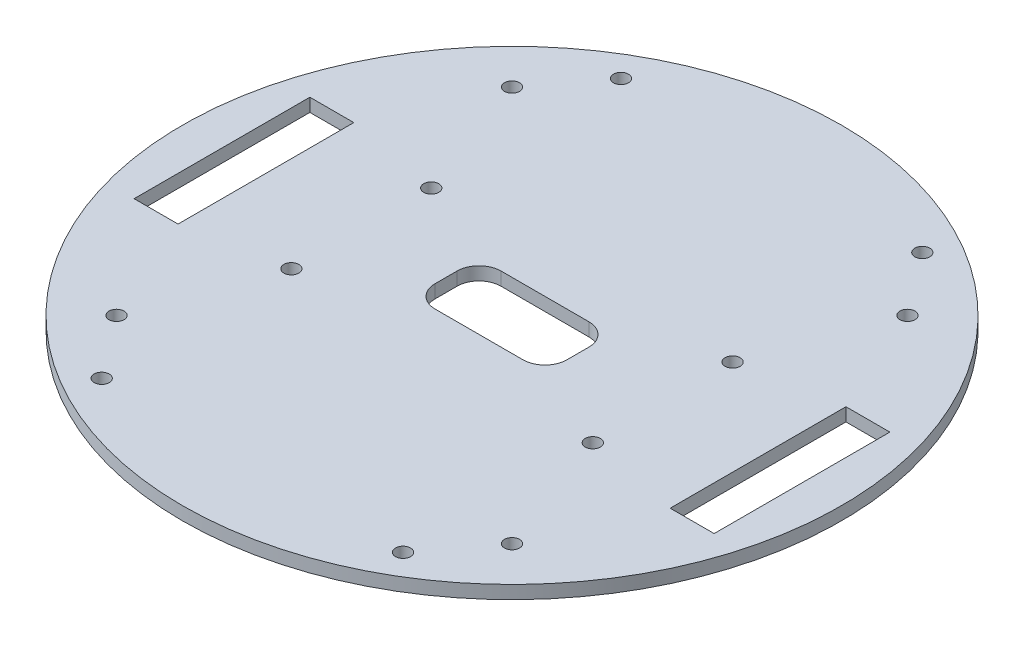
ISO-10303-21;
HEADER;
FILE_DESCRIPTION(('STEP AP214'),'2;1');
FILE_NAME('part.step','',(''),(''),'','','');
FILE_SCHEMA(('AUTOMOTIVE_DESIGN { 1 0 10303 214 1 1 1 1 }'));
ENDSEC;
DATA;
#1=APPLICATION_CONTEXT('core data for automotive mechanical design processes');
#2=APPLICATION_PROTOCOL_DEFINITION('international standard','automotive_design',2000,#1);
#3=PRODUCT_CONTEXT('',#1,'mechanical');
#4=PRODUCT('Part','Part','',(#3));
#5=PRODUCT_RELATED_PRODUCT_CATEGORY('part','',(#4));
#6=PRODUCT_DEFINITION_FORMATION('','',#4);
#7=PRODUCT_DEFINITION_CONTEXT('part definition',#1,'design');
#8=PRODUCT_DEFINITION('design','',#6,#7);
#9=PRODUCT_DEFINITION_SHAPE('','',#8);
#10=(LENGTH_UNIT() NAMED_UNIT(*) SI_UNIT(.MILLI.,.METRE.));
#11=(NAMED_UNIT(*) PLANE_ANGLE_UNIT() SI_UNIT($,.RADIAN.));
#12=(NAMED_UNIT(*) SI_UNIT($,.STERADIAN.) SOLID_ANGLE_UNIT());
#13=UNCERTAINTY_MEASURE_WITH_UNIT(LENGTH_MEASURE(1.E-05),#10,'distance_accuracy_value','');
#14=(GEOMETRIC_REPRESENTATION_CONTEXT(3) GLOBAL_UNCERTAINTY_ASSIGNED_CONTEXT((#13)) GLOBAL_UNIT_ASSIGNED_CONTEXT((#10,
#11,#12)) REPRESENTATION_CONTEXT('',''));
#15=CARTESIAN_POINT('',(0.,0.,0.));
#16=DIRECTION('',(0.,0.,1.));
#17=DIRECTION('',(1.,0.,0.));
#18=AXIS2_PLACEMENT_3D('',#15,#16,#17);
#19=CARTESIAN_POINT('',(0.,3.,0.));
#20=DIRECTION('',(0.,-1.,0.));
#21=DIRECTION('',(0.,0.,-1.));
#22=AXIS2_PLACEMENT_3D('',#19,#20,#21);
#23=CYLINDRICAL_SURFACE('',#22,75.);
#24=CARTESIAN_POINT('',(0.,3.,0.));
#25=DIRECTION('',(0.,1.,0.));
#26=DIRECTION('',(0.,0.,1.));
#27=AXIS2_PLACEMENT_3D('',#24,#25,#26);
#28=CIRCLE('',#27,75.);
#29=CARTESIAN_POINT('',(0.,3.,75.));
#30=VERTEX_POINT('',#29);
#31=EDGE_CURVE('E205',#30,#30,#28,.T.);
#32=ORIENTED_EDGE('',*,*,#31,.F.);
#33=EDGE_LOOP('',(#32));
#34=FACE_BOUND('',#33,.T.);
#35=CARTESIAN_POINT('',(0.,0.,0.));
#36=DIRECTION('',(0.,1.,0.));
#37=DIRECTION('',(0.,0.,1.));
#38=AXIS2_PLACEMENT_3D('',#35,#36,#37);
#39=CIRCLE('',#38,75.);
#40=CARTESIAN_POINT('',(0.,0.,75.));
#41=VERTEX_POINT('',#40);
#42=EDGE_CURVE('E198',#41,#41,#39,.T.);
#43=ORIENTED_EDGE('',*,*,#42,.T.);
#44=EDGE_LOOP('',(#43));
#45=FACE_BOUND('',#44,.T.);
#46=ADVANCED_FACE('F33',(#34,#45),#23,.T.);
#47=CARTESIAN_POINT('',(0.,3.,0.));
#48=DIRECTION('',(0.,1.,0.));
#49=DIRECTION('',(0.,0.,1.));
#50=AXIS2_PLACEMENT_3D('',#47,#48,#49);
#51=PLANE('',#50);
#52=CARTESIAN_POINT('',(34.29,3.,15.91));
#53=DIRECTION('',(0.,1.,0.));
#54=DIRECTION('',(0.,0.,1.));
#55=AXIS2_PLACEMENT_3D('',#52,#53,#54);
#56=CIRCLE('',#55,1.7145);
#57=CARTESIAN_POINT('',(34.29,3.,17.6245));
#58=VERTEX_POINT('',#57);
#59=EDGE_CURVE('E298',#58,#58,#56,.T.);
#60=ORIENTED_EDGE('',*,*,#59,.F.);
#61=EDGE_LOOP('',(#60));
#62=FACE_BOUND('',#61,.T.);
#63=CARTESIAN_POINT('',(34.29,3.,59.09));
#64=DIRECTION('',(0.,1.,0.));
#65=DIRECTION('',(0.,0.,1.));
#66=AXIS2_PLACEMENT_3D('',#63,#64,#65);
#67=CIRCLE('',#66,1.7145);
#68=CARTESIAN_POINT('',(34.29,3.,60.8045));
#69=VERTEX_POINT('',#68);
#70=EDGE_CURVE('E288',#69,#69,#67,.T.);
#71=ORIENTED_EDGE('',*,*,#70,.F.);
#72=EDGE_LOOP('',(#71));
#73=FACE_BOUND('',#72,.T.);
#74=CARTESIAN_POINT('',(-34.29,3.,59.09));
#75=DIRECTION('',(0.,1.,0.));
#76=DIRECTION('',(0.,0.,1.));
#77=AXIS2_PLACEMENT_3D('',#74,#75,#76);
#78=CIRCLE('',#77,1.7145);
#79=CARTESIAN_POINT('',(-34.29,3.,60.8045));
#80=VERTEX_POINT('',#79);
#81=EDGE_CURVE('E285',#80,#80,#78,.T.);
#82=ORIENTED_EDGE('',*,*,#81,.F.);
#83=EDGE_LOOP('',(#82));
#84=FACE_BOUND('',#83,.T.);
#85=CARTESIAN_POINT('',(-34.29,3.,15.91));
#86=DIRECTION('',(0.,1.,0.));
#87=DIRECTION('',(0.,0.,1.));
#88=AXIS2_PLACEMENT_3D('',#85,#86,#87);
#89=CIRCLE('',#88,1.7145);
#90=CARTESIAN_POINT('',(-34.29,3.,17.6245));
#91=VERTEX_POINT('',#90);
#92=EDGE_CURVE('E282',#91,#91,#89,.T.);
#93=ORIENTED_EDGE('',*,*,#92,.F.);
#94=EDGE_LOOP('',(#93));
#95=FACE_BOUND('',#94,.T.);
#96=CARTESIAN_POINT('',(-34.29,3.,-59.09));
#97=DIRECTION('',(0.,1.,0.));
#98=DIRECTION('',(0.,0.,1.));
#99=AXIS2_PLACEMENT_3D('',#96,#97,#98);
#100=CIRCLE('',#99,1.7145);
#101=CARTESIAN_POINT('',(-34.29,3.,-57.3755));
#102=VERTEX_POINT('',#101);
#103=EDGE_CURVE('E278',#102,#102,#100,.T.);
#104=ORIENTED_EDGE('',*,*,#103,.F.);
#105=EDGE_LOOP('',(#104));
#106=FACE_BOUND('',#105,.T.);
#107=CARTESIAN_POINT('',(-34.29,3.,-15.91));
#108=DIRECTION('',(0.,1.,0.));
#109=DIRECTION('',(0.,0.,1.));
#110=AXIS2_PLACEMENT_3D('',#107,#108,#109);
#111=CIRCLE('',#110,1.7145);
#112=CARTESIAN_POINT('',(-34.29,3.,-14.1955));
#113=VERTEX_POINT('',#112);
#114=EDGE_CURVE('E274',#113,#113,#111,.T.);
#115=ORIENTED_EDGE('',*,*,#114,.F.);
#116=EDGE_LOOP('',(#115));
#117=FACE_BOUND('',#116,.T.);
#118=CARTESIAN_POINT('',(34.29,3.,-15.91));
#119=DIRECTION('',(0.,1.,0.));
#120=DIRECTION('',(0.,0.,1.));
#121=AXIS2_PLACEMENT_3D('',#118,#119,#120);
#122=CIRCLE('',#121,1.7145);
#123=CARTESIAN_POINT('',(34.29,3.,-14.1955));
#124=VERTEX_POINT('',#123);
#125=EDGE_CURVE('E270',#124,#124,#122,.T.);
#126=ORIENTED_EDGE('',*,*,#125,.F.);
#127=EDGE_LOOP('',(#126));
#128=FACE_BOUND('',#127,.T.);
#129=CARTESIAN_POINT('',(34.29,3.,-59.09));
#130=DIRECTION('',(0.,1.,0.));
#131=DIRECTION('',(0.,0.,1.));
#132=AXIS2_PLACEMENT_3D('',#129,#130,#131);
#133=CIRCLE('',#132,1.7145);
#134=CARTESIAN_POINT('',(34.29,3.,-57.3755));
#135=VERTEX_POINT('',#134);
#136=EDGE_CURVE('E266',#135,#135,#133,.T.);
#137=ORIENTED_EDGE('',*,*,#136,.F.);
#138=EDGE_LOOP('',(#137));
#139=FACE_BOUND('',#138,.T.);
#140=DIRECTION('',(0.,0.,-1.));
#141=VECTOR('',#140,1.);
#142=CARTESIAN_POINT('',(15.,3.,7.5));
#143=LINE('',#142,#141);
#144=CARTESIAN_POINT('',(15.,3.,2.5));
#145=VERTEX_POINT('',#144);
#146=CARTESIAN_POINT('',(15.,3.,-2.5));
#147=VERTEX_POINT('',#146);
#148=EDGE_CURVE('E265',#145,#147,#143,.T.);
#149=ORIENTED_EDGE('',*,*,#148,.F.);
#150=CARTESIAN_POINT('',(9.99999999999999,3.,2.5));
#151=DIRECTION('',(0.,1.,0.));
#152=DIRECTION('',(0.,0.,1.));
#153=AXIS2_PLACEMENT_3D('',#150,#151,#152);
#154=CIRCLE('',#153,5.);
#155=CARTESIAN_POINT('',(9.99999999999999,3.,7.5));
#156=VERTEX_POINT('',#155);
#157=EDGE_CURVE('E254',#145,#156,#154,.F.);
#158=ORIENTED_EDGE('',*,*,#157,.T.);
#159=DIRECTION('',(1.,0.,0.));
#160=VECTOR('',#159,1.);
#161=CARTESIAN_POINT('',(-15.,3.,7.5));
#162=LINE('',#161,#160);
#163=CARTESIAN_POINT('',(-10.,3.,7.5));
#164=VERTEX_POINT('',#163);
#165=EDGE_CURVE('E314',#164,#156,#162,.T.);
#166=ORIENTED_EDGE('',*,*,#165,.F.);
#167=CARTESIAN_POINT('',(-10.,3.,2.5));
#168=DIRECTION('',(0.,1.,0.));
#169=DIRECTION('',(0.,0.,1.));
#170=AXIS2_PLACEMENT_3D('',#167,#168,#169);
#171=CIRCLE('',#170,5.);
#172=CARTESIAN_POINT('',(-15.,3.,2.5));
#173=VERTEX_POINT('',#172);
#174=EDGE_CURVE('E250',#164,#173,#171,.F.);
#175=ORIENTED_EDGE('',*,*,#174,.T.);
#176=DIRECTION('',(0.,0.,1.));
#177=VECTOR('',#176,1.);
#178=CARTESIAN_POINT('',(-15.,3.,7.5));
#179=LINE('',#178,#177);
#180=CARTESIAN_POINT('',(-15.,3.,-2.5));
#181=VERTEX_POINT('',#180);
#182=EDGE_CURVE('E327',#181,#173,#179,.T.);
#183=ORIENTED_EDGE('',*,*,#182,.F.);
#184=CARTESIAN_POINT('',(-10.,3.,-2.5));
#185=DIRECTION('',(0.,1.,0.));
#186=DIRECTION('',(0.,0.,1.));
#187=AXIS2_PLACEMENT_3D('',#184,#185,#186);
#188=CIRCLE('',#187,5.);
#189=CARTESIAN_POINT('',(-10.,3.,-7.5));
#190=VERTEX_POINT('',#189);
#191=EDGE_CURVE('E42',#181,#190,#188,.F.);
#192=ORIENTED_EDGE('',*,*,#191,.T.);
#193=DIRECTION('',(-1.,0.,0.));
#194=VECTOR('',#193,1.);
#195=CARTESIAN_POINT('',(-15.,3.,-7.5));
#196=LINE('',#195,#194);
#197=CARTESIAN_POINT('',(9.99999999999999,3.,-7.5));
#198=VERTEX_POINT('',#197);
#199=EDGE_CURVE('E325',#198,#190,#196,.T.);
#200=ORIENTED_EDGE('',*,*,#199,.F.);
#201=CARTESIAN_POINT('',(9.99999999999999,3.,-2.5));
#202=DIRECTION('',(0.,1.,0.));
#203=DIRECTION('',(0.,0.,1.));
#204=AXIS2_PLACEMENT_3D('',#201,#202,#203);
#205=CIRCLE('',#204,5.);
#206=EDGE_CURVE('E258',#198,#147,#205,.F.);
#207=ORIENTED_EDGE('',*,*,#206,.T.);
#208=EDGE_LOOP('',(#149,#158,#166,#175,#183,#192,#200,#207));
#209=FACE_BOUND('',#208,.T.);
#210=CARTESIAN_POINT('',(-45.,3.,45.));
#211=DIRECTION('',(0.,1.,0.));
#212=DIRECTION('',(0.,0.,1.));
#213=AXIS2_PLACEMENT_3D('',#210,#211,#212);
#214=CIRCLE('',#213,1.7145);
#215=CARTESIAN_POINT('',(-45.,3.,46.7145));
#216=VERTEX_POINT('',#215);
#217=EDGE_CURVE('E322',#216,#216,#214,.T.);
#218=ORIENTED_EDGE('',*,*,#217,.F.);
#219=EDGE_LOOP('',(#218));
#220=FACE_BOUND('',#219,.T.);
#221=CARTESIAN_POINT('',(45.,3.,45.));
#222=DIRECTION('',(0.,1.,0.));
#223=DIRECTION('',(0.,0.,1.));
#224=AXIS2_PLACEMENT_3D('',#221,#222,#223);
#225=CIRCLE('',#224,1.7145);
#226=CARTESIAN_POINT('',(45.,3.,46.7145));
#227=VERTEX_POINT('',#226);
#228=EDGE_CURVE('E335',#227,#227,#225,.T.);
#229=ORIENTED_EDGE('',*,*,#228,.F.);
#230=EDGE_LOOP('',(#229));
#231=FACE_BOUND('',#230,.T.);
#232=CARTESIAN_POINT('',(45.,3.,-45.));
#233=DIRECTION('',(0.,1.,0.));
#234=DIRECTION('',(0.,0.,1.));
#235=AXIS2_PLACEMENT_3D('',#232,#233,#234);
#236=CIRCLE('',#235,1.7145);
#237=CARTESIAN_POINT('',(45.,3.,-43.2855));
#238=VERTEX_POINT('',#237);
#239=EDGE_CURVE('E341',#238,#238,#236,.T.);
#240=ORIENTED_EDGE('',*,*,#239,.F.);
#241=EDGE_LOOP('',(#240));
#242=FACE_BOUND('',#241,.T.);
#243=CARTESIAN_POINT('',(-45.,3.,-45.));
#244=DIRECTION('',(0.,1.,0.));
#245=DIRECTION('',(0.,0.,1.));
#246=AXIS2_PLACEMENT_3D('',#243,#244,#245);
#247=CIRCLE('',#246,1.7145);
#248=CARTESIAN_POINT('',(-45.,3.,-43.2855));
#249=VERTEX_POINT('',#248);
#250=EDGE_CURVE('E347',#249,#249,#247,.T.);
#251=ORIENTED_EDGE('',*,*,#250,.F.);
#252=EDGE_LOOP('',(#251));
#253=FACE_BOUND('',#252,.T.);
#254=DIRECTION('',(0.,0.,-1.));
#255=VECTOR('',#254,1.);
#256=CARTESIAN_POINT('',(66.,3.,20.));
#257=LINE('',#256,#255);
#258=CARTESIAN_POINT('',(66.,3.,20.));
#259=VERTEX_POINT('',#258);
#260=CARTESIAN_POINT('',(66.,3.,-20.));
#261=VERTEX_POINT('',#260);
#262=EDGE_CURVE('E170',#259,#261,#257,.T.);
#263=ORIENTED_EDGE('',*,*,#262,.F.);
#264=DIRECTION('',(1.,0.,0.));
#265=VECTOR('',#264,1.);
#266=CARTESIAN_POINT('',(56.,3.,20.));
#267=LINE('',#266,#265);
#268=CARTESIAN_POINT('',(56.,3.,20.));
#269=VERTEX_POINT('',#268);
#270=EDGE_CURVE('E175',#269,#259,#267,.T.);
#271=ORIENTED_EDGE('',*,*,#270,.F.);
#272=DIRECTION('',(0.,0.,1.));
#273=VECTOR('',#272,1.);
#274=CARTESIAN_POINT('',(56.,3.,20.));
#275=LINE('',#274,#273);
#276=CARTESIAN_POINT('',(56.,3.,-20.));
#277=VERTEX_POINT('',#276);
#278=EDGE_CURVE('E154',#277,#269,#275,.T.);
#279=ORIENTED_EDGE('',*,*,#278,.F.);
#280=DIRECTION('',(-1.,0.,0.));
#281=VECTOR('',#280,1.);
#282=CARTESIAN_POINT('',(56.,3.,-20.));
#283=LINE('',#282,#281);
#284=EDGE_CURVE('E165',#261,#277,#283,.T.);
#285=ORIENTED_EDGE('',*,*,#284,.F.);
#286=EDGE_LOOP('',(#263,#271,#279,#285));
#287=FACE_BOUND('',#286,.T.);
#288=DIRECTION('',(0.,0.,-1.));
#289=VECTOR('',#288,1.);
#290=CARTESIAN_POINT('',(-56.,3.,20.));
#291=LINE('',#290,#289);
#292=CARTESIAN_POINT('',(-56.,3.,20.));
#293=VERTEX_POINT('',#292);
#294=CARTESIAN_POINT('',(-56.,3.,-20.));
#295=VERTEX_POINT('',#294);
#296=EDGE_CURVE('E182',#293,#295,#291,.T.);
#297=ORIENTED_EDGE('',*,*,#296,.F.);
#298=DIRECTION('',(1.,0.,0.));
#299=VECTOR('',#298,1.);
#300=CARTESIAN_POINT('',(-66.,3.,20.));
#301=LINE('',#300,#299);
#302=CARTESIAN_POINT('',(-66.,3.,20.));
#303=VERTEX_POINT('',#302);
#304=EDGE_CURVE('E192',#303,#293,#301,.T.);
#305=ORIENTED_EDGE('',*,*,#304,.F.);
#306=DIRECTION('',(0.,0.,1.));
#307=VECTOR('',#306,1.);
#308=CARTESIAN_POINT('',(-66.,3.,20.));
#309=LINE('',#308,#307);
#310=CARTESIAN_POINT('',(-66.,3.,-20.));
#311=VERTEX_POINT('',#310);
#312=EDGE_CURVE('E189',#311,#303,#309,.T.);
#313=ORIENTED_EDGE('',*,*,#312,.F.);
#314=DIRECTION('',(-1.,0.,0.));
#315=VECTOR('',#314,1.);
#316=CARTESIAN_POINT('',(-66.,3.,-20.));
#317=LINE('',#316,#315);
#318=EDGE_CURVE('E186',#295,#311,#317,.T.);
#319=ORIENTED_EDGE('',*,*,#318,.F.);
#320=EDGE_LOOP('',(#297,#305,#313,#319));
#321=FACE_BOUND('',#320,.T.);
#322=ORIENTED_EDGE('',*,*,#31,.T.);
#323=EDGE_LOOP('',(#322));
#324=FACE_BOUND('',#323,.T.);
#325=ADVANCED_FACE('F172',(#62,#73,#84,#95,#106,#117,#128,#139,#209,#220,#231,#242,#253,#287,
#321,#324),#51,.T.);
#326=CARTESIAN_POINT('',(0.,0.,0.));
#327=DIRECTION('',(0.,1.,0.));
#328=DIRECTION('',(0.,0.,1.));
#329=AXIS2_PLACEMENT_3D('',#326,#327,#328);
#330=PLANE('',#329);
#331=CARTESIAN_POINT('',(34.29,0.,15.91));
#332=DIRECTION('',(0.,1.,0.));
#333=DIRECTION('',(0.,0.,1.));
#334=AXIS2_PLACEMENT_3D('',#331,#332,#333);
#335=CIRCLE('',#334,1.7145);
#336=CARTESIAN_POINT('',(34.29,0.,17.6245));
#337=VERTEX_POINT('',#336);
#338=EDGE_CURVE('E37',#337,#337,#335,.T.);
#339=ORIENTED_EDGE('',*,*,#338,.T.);
#340=EDGE_LOOP('',(#339));
#341=FACE_BOUND('',#340,.T.);
#342=CARTESIAN_POINT('',(34.29,0.,59.09));
#343=DIRECTION('',(0.,1.,0.));
#344=DIRECTION('',(0.,0.,1.));
#345=AXIS2_PLACEMENT_3D('',#342,#343,#344);
#346=CIRCLE('',#345,1.7145);
#347=CARTESIAN_POINT('',(34.29,0.,60.8045));
#348=VERTEX_POINT('',#347);
#349=EDGE_CURVE('E286',#348,#348,#346,.T.);
#350=ORIENTED_EDGE('',*,*,#349,.T.);
#351=EDGE_LOOP('',(#350));
#352=FACE_BOUND('',#351,.T.);
#353=CARTESIAN_POINT('',(-34.29,0.,59.09));
#354=DIRECTION('',(0.,1.,0.));
#355=DIRECTION('',(0.,0.,1.));
#356=AXIS2_PLACEMENT_3D('',#353,#354,#355);
#357=CIRCLE('',#356,1.7145);
#358=CARTESIAN_POINT('',(-34.29,0.,60.8045));
#359=VERTEX_POINT('',#358);
#360=EDGE_CURVE('E283',#359,#359,#357,.T.);
#361=ORIENTED_EDGE('',*,*,#360,.T.);
#362=EDGE_LOOP('',(#361));
#363=FACE_BOUND('',#362,.T.);
#364=CARTESIAN_POINT('',(-34.29,0.,15.91));
#365=DIRECTION('',(0.,1.,0.));
#366=DIRECTION('',(0.,0.,1.));
#367=AXIS2_PLACEMENT_3D('',#364,#365,#366);
#368=CIRCLE('',#367,1.7145);
#369=CARTESIAN_POINT('',(-34.29,0.,17.6245));
#370=VERTEX_POINT('',#369);
#371=EDGE_CURVE('E279',#370,#370,#368,.T.);
#372=ORIENTED_EDGE('',*,*,#371,.T.);
#373=EDGE_LOOP('',(#372));
#374=FACE_BOUND('',#373,.T.);
#375=CARTESIAN_POINT('',(-34.29,0.,-59.09));
#376=DIRECTION('',(0.,1.,0.));
#377=DIRECTION('',(0.,0.,1.));
#378=AXIS2_PLACEMENT_3D('',#375,#376,#377);
#379=CIRCLE('',#378,1.7145);
#380=CARTESIAN_POINT('',(-34.29,0.,-57.3755));
#381=VERTEX_POINT('',#380);
#382=EDGE_CURVE('E275',#381,#381,#379,.T.);
#383=ORIENTED_EDGE('',*,*,#382,.T.);
#384=EDGE_LOOP('',(#383));
#385=FACE_BOUND('',#384,.T.);
#386=CARTESIAN_POINT('',(-34.29,0.,-15.91));
#387=DIRECTION('',(0.,1.,0.));
#388=DIRECTION('',(0.,0.,1.));
#389=AXIS2_PLACEMENT_3D('',#386,#387,#388);
#390=CIRCLE('',#389,1.7145);
#391=CARTESIAN_POINT('',(-34.29,0.,-14.1955));
#392=VERTEX_POINT('',#391);
#393=EDGE_CURVE('E271',#392,#392,#390,.T.);
#394=ORIENTED_EDGE('',*,*,#393,.T.);
#395=EDGE_LOOP('',(#394));
#396=FACE_BOUND('',#395,.T.);
#397=CARTESIAN_POINT('',(34.29,0.,-15.91));
#398=DIRECTION('',(0.,1.,0.));
#399=DIRECTION('',(0.,0.,1.));
#400=AXIS2_PLACEMENT_3D('',#397,#398,#399);
#401=CIRCLE('',#400,1.7145);
#402=CARTESIAN_POINT('',(34.29,0.,-14.1955));
#403=VERTEX_POINT('',#402);
#404=EDGE_CURVE('E267',#403,#403,#401,.T.);
#405=ORIENTED_EDGE('',*,*,#404,.T.);
#406=EDGE_LOOP('',(#405));
#407=FACE_BOUND('',#406,.T.);
#408=CARTESIAN_POINT('',(34.29,0.,-59.09));
#409=DIRECTION('',(0.,1.,0.));
#410=DIRECTION('',(0.,0.,1.));
#411=AXIS2_PLACEMENT_3D('',#408,#409,#410);
#412=CIRCLE('',#411,1.7145);
#413=CARTESIAN_POINT('',(34.29,0.,-57.3755));
#414=VERTEX_POINT('',#413);
#415=EDGE_CURVE('E262',#414,#414,#412,.T.);
#416=ORIENTED_EDGE('',*,*,#415,.T.);
#417=EDGE_LOOP('',(#416));
#418=FACE_BOUND('',#417,.T.);
#419=DIRECTION('',(0.,0.,1.));
#420=VECTOR('',#419,1.);
#421=CARTESIAN_POINT('',(-15.,0.,7.5));
#422=LINE('',#421,#420);
#423=CARTESIAN_POINT('',(-15.,0.,-2.5));
#424=VERTEX_POINT('',#423);
#425=CARTESIAN_POINT('',(-15.,0.,2.5));
#426=VERTEX_POINT('',#425);
#427=EDGE_CURVE('E316',#424,#426,#422,.T.);
#428=ORIENTED_EDGE('',*,*,#427,.T.);
#429=CARTESIAN_POINT('',(-10.,0.,2.5));
#430=DIRECTION('',(0.,1.,0.));
#431=DIRECTION('',(0.,0.,1.));
#432=AXIS2_PLACEMENT_3D('',#429,#430,#431);
#433=CIRCLE('',#432,5.);
#434=CARTESIAN_POINT('',(-10.,0.,7.5));
#435=VERTEX_POINT('',#434);
#436=EDGE_CURVE('E252',#426,#435,#433,.T.);
#437=ORIENTED_EDGE('',*,*,#436,.T.);
#438=DIRECTION('',(1.,0.,0.));
#439=VECTOR('',#438,1.);
#440=CARTESIAN_POINT('',(-15.,0.,7.5));
#441=LINE('',#440,#439);
#442=CARTESIAN_POINT('',(9.99999999999999,0.,7.5));
#443=VERTEX_POINT('',#442);
#444=EDGE_CURVE('E319',#435,#443,#441,.T.);
#445=ORIENTED_EDGE('',*,*,#444,.T.);
#446=CARTESIAN_POINT('',(9.99999999999999,0.,2.5));
#447=DIRECTION('',(0.,1.,0.));
#448=DIRECTION('',(0.,0.,1.));
#449=AXIS2_PLACEMENT_3D('',#446,#447,#448);
#450=CIRCLE('',#449,5.);
#451=CARTESIAN_POINT('',(15.,0.,2.5));
#452=VERTEX_POINT('',#451);
#453=EDGE_CURVE('E256',#443,#452,#450,.T.);
#454=ORIENTED_EDGE('',*,*,#453,.T.);
#455=DIRECTION('',(0.,0.,-1.));
#456=VECTOR('',#455,1.);
#457=CARTESIAN_POINT('',(15.,0.,7.5));
#458=LINE('',#457,#456);
#459=CARTESIAN_POINT('',(15.,0.,-2.5));
#460=VERTEX_POINT('',#459);
#461=EDGE_CURVE('E311',#452,#460,#458,.T.);
#462=ORIENTED_EDGE('',*,*,#461,.T.);
#463=CARTESIAN_POINT('',(9.99999999999999,0.,-2.5));
#464=DIRECTION('',(0.,1.,0.));
#465=DIRECTION('',(0.,0.,1.));
#466=AXIS2_PLACEMENT_3D('',#463,#464,#465);
#467=CIRCLE('',#466,5.);
#468=CARTESIAN_POINT('',(9.99999999999999,0.,-7.5));
#469=VERTEX_POINT('',#468);
#470=EDGE_CURVE('E57',#460,#469,#467,.T.);
#471=ORIENTED_EDGE('',*,*,#470,.T.);
#472=DIRECTION('',(-1.,0.,0.));
#473=VECTOR('',#472,1.);
#474=CARTESIAN_POINT('',(-15.,0.,-7.5));
#475=LINE('',#474,#473);
#476=CARTESIAN_POINT('',(-10.,0.,-7.5));
#477=VERTEX_POINT('',#476);
#478=EDGE_CURVE('E313',#469,#477,#475,.T.);
#479=ORIENTED_EDGE('',*,*,#478,.T.);
#480=CARTESIAN_POINT('',(-10.,0.,-2.5));
#481=DIRECTION('',(0.,1.,0.));
#482=DIRECTION('',(0.,0.,1.));
#483=AXIS2_PLACEMENT_3D('',#480,#481,#482);
#484=CIRCLE('',#483,5.);
#485=EDGE_CURVE('E11',#477,#424,#484,.T.);
#486=ORIENTED_EDGE('',*,*,#485,.T.);
#487=EDGE_LOOP('',(#428,#437,#445,#454,#462,#471,#479,#486));
#488=FACE_BOUND('',#487,.T.);
#489=CARTESIAN_POINT('',(-45.,0.,45.));
#490=DIRECTION('',(0.,1.,0.));
#491=DIRECTION('',(0.,0.,1.));
#492=AXIS2_PLACEMENT_3D('',#489,#490,#491);
#493=CIRCLE('',#492,1.7145);
#494=CARTESIAN_POINT('',(-45.,0.,46.7145));
#495=VERTEX_POINT('',#494);
#496=EDGE_CURVE('E332',#495,#495,#493,.T.);
#497=ORIENTED_EDGE('',*,*,#496,.T.);
#498=EDGE_LOOP('',(#497));
#499=FACE_BOUND('',#498,.T.);
#500=CARTESIAN_POINT('',(45.,0.,45.));
#501=DIRECTION('',(0.,1.,0.));
#502=DIRECTION('',(0.,0.,1.));
#503=AXIS2_PLACEMENT_3D('',#500,#501,#502);
#504=CIRCLE('',#503,1.7145);
#505=CARTESIAN_POINT('',(45.,0.,46.7145));
#506=VERTEX_POINT('',#505);
#507=EDGE_CURVE('E338',#506,#506,#504,.T.);
#508=ORIENTED_EDGE('',*,*,#507,.T.);
#509=EDGE_LOOP('',(#508));
#510=FACE_BOUND('',#509,.T.);
#511=CARTESIAN_POINT('',(45.,0.,-45.));
#512=DIRECTION('',(0.,1.,0.));
#513=DIRECTION('',(0.,0.,1.));
#514=AXIS2_PLACEMENT_3D('',#511,#512,#513);
#515=CIRCLE('',#514,1.7145);
#516=CARTESIAN_POINT('',(45.,0.,-43.2855));
#517=VERTEX_POINT('',#516);
#518=EDGE_CURVE('E344',#517,#517,#515,.T.);
#519=ORIENTED_EDGE('',*,*,#518,.T.);
#520=EDGE_LOOP('',(#519));
#521=FACE_BOUND('',#520,.T.);
#522=CARTESIAN_POINT('',(-45.,0.,-45.));
#523=DIRECTION('',(0.,1.,0.));
#524=DIRECTION('',(0.,0.,1.));
#525=AXIS2_PLACEMENT_3D('',#522,#523,#524);
#526=CIRCLE('',#525,1.7145);
#527=CARTESIAN_POINT('',(-45.,0.,-43.2855));
#528=VERTEX_POINT('',#527);
#529=EDGE_CURVE('E350',#528,#528,#526,.T.);
#530=ORIENTED_EDGE('',*,*,#529,.T.);
#531=EDGE_LOOP('',(#530));
#532=FACE_BOUND('',#531,.T.);
#533=DIRECTION('',(1.,0.,0.));
#534=VECTOR('',#533,1.);
#535=CARTESIAN_POINT('',(0.,0.,20.));
#536=LINE('',#535,#534);
#537=CARTESIAN_POINT('',(56.,0.,20.));
#538=VERTEX_POINT('',#537);
#539=CARTESIAN_POINT('',(66.,0.,20.));
#540=VERTEX_POINT('',#539);
#541=EDGE_CURVE('E225',#538,#540,#536,.T.);
#542=ORIENTED_EDGE('',*,*,#541,.T.);
#543=DIRECTION('',(0.,0.,-1.));
#544=VECTOR('',#543,1.);
#545=CARTESIAN_POINT('',(66.,0.,0.));
#546=LINE('',#545,#544);
#547=CARTESIAN_POINT('',(66.,0.,-20.));
#548=VERTEX_POINT('',#547);
#549=EDGE_CURVE('E228',#540,#548,#546,.T.);
#550=ORIENTED_EDGE('',*,*,#549,.T.);
#551=DIRECTION('',(-1.,0.,0.));
#552=VECTOR('',#551,1.);
#553=CARTESIAN_POINT('',(0.,0.,-20.));
#554=LINE('',#553,#552);
#555=CARTESIAN_POINT('',(56.,0.,-20.));
#556=VERTEX_POINT('',#555);
#557=EDGE_CURVE('E222',#548,#556,#554,.T.);
#558=ORIENTED_EDGE('',*,*,#557,.T.);
#559=DIRECTION('',(0.,0.,1.));
#560=VECTOR('',#559,1.);
#561=CARTESIAN_POINT('',(56.,0.,0.));
#562=LINE('',#561,#560);
#563=EDGE_CURVE('E157',#556,#538,#562,.T.);
#564=ORIENTED_EDGE('',*,*,#563,.T.);
#565=EDGE_LOOP('',(#542,#550,#558,#564));
#566=FACE_BOUND('',#565,.T.);
#567=DIRECTION('',(1.,0.,0.));
#568=VECTOR('',#567,1.);
#569=CARTESIAN_POINT('',(0.,0.,20.));
#570=LINE('',#569,#568);
#571=CARTESIAN_POINT('',(-66.,0.,20.));
#572=VERTEX_POINT('',#571);
#573=CARTESIAN_POINT('',(-56.,0.,20.));
#574=VERTEX_POINT('',#573);
#575=EDGE_CURVE('E216',#572,#574,#570,.T.);
#576=ORIENTED_EDGE('',*,*,#575,.T.);
#577=DIRECTION('',(0.,0.,-1.));
#578=VECTOR('',#577,1.);
#579=CARTESIAN_POINT('',(-56.,0.,0.));
#580=LINE('',#579,#578);
#581=CARTESIAN_POINT('',(-56.,0.,-20.));
#582=VERTEX_POINT('',#581);
#583=EDGE_CURVE('E219',#574,#582,#580,.T.);
#584=ORIENTED_EDGE('',*,*,#583,.T.);
#585=DIRECTION('',(-1.,0.,0.));
#586=VECTOR('',#585,1.);
#587=CARTESIAN_POINT('',(0.,0.,-20.));
#588=LINE('',#587,#586);
#589=CARTESIAN_POINT('',(-66.,0.,-20.));
#590=VERTEX_POINT('',#589);
#591=EDGE_CURVE('E208',#582,#590,#588,.T.);
#592=ORIENTED_EDGE('',*,*,#591,.T.);
#593=DIRECTION('',(0.,0.,1.));
#594=VECTOR('',#593,1.);
#595=CARTESIAN_POINT('',(-66.,0.,0.));
#596=LINE('',#595,#594);
#597=EDGE_CURVE('E213',#590,#572,#596,.T.);
#598=ORIENTED_EDGE('',*,*,#597,.T.);
#599=EDGE_LOOP('',(#576,#584,#592,#598));
#600=FACE_BOUND('',#599,.T.);
#601=ORIENTED_EDGE('',*,*,#42,.F.);
#602=EDGE_LOOP('',(#601));
#603=FACE_BOUND('',#602,.T.);
#604=ADVANCED_FACE('F360',(#341,#352,#363,#374,#385,#396,#407,#418,#488,#499,#510,#521,#532,
#566,#600,#603),#330,.F.);
#605=CARTESIAN_POINT('',(-56.,-3.35,20.));
#606=DIRECTION('',(1.,0.,0.));
#607=DIRECTION('',(0.,0.,-1.));
#608=AXIS2_PLACEMENT_3D('',#605,#606,#607);
#609=PLANE('',#608);
#610=DIRECTION('',(0.,1.,0.));
#611=VECTOR('',#610,1.);
#612=CARTESIAN_POINT('',(-56.,-3.35,20.));
#613=LINE('',#612,#611);
#614=EDGE_CURVE('E196',#574,#293,#613,.T.);
#615=ORIENTED_EDGE('',*,*,#614,.T.);
#616=ORIENTED_EDGE('',*,*,#296,.T.);
#617=DIRECTION('',(0.,1.,0.));
#618=VECTOR('',#617,1.);
#619=CARTESIAN_POINT('',(-56.,-3.35,-20.));
#620=LINE('',#619,#618);
#621=EDGE_CURVE('E195',#582,#295,#620,.T.);
#622=ORIENTED_EDGE('',*,*,#621,.F.);
#623=ORIENTED_EDGE('',*,*,#583,.F.);
#624=EDGE_LOOP('',(#615,#616,#622,#623));
#625=FACE_BOUND('',#624,.T.);
#626=ADVANCED_FACE('F363',(#625),#609,.F.);
#627=CARTESIAN_POINT('',(-66.,-3.35,20.));
#628=DIRECTION('',(0.,0.,1.));
#629=DIRECTION('',(1.,0.,0.));
#630=AXIS2_PLACEMENT_3D('',#627,#628,#629);
#631=PLANE('',#630);
#632=DIRECTION('',(0.,1.,0.));
#633=VECTOR('',#632,1.);
#634=CARTESIAN_POINT('',(-66.,-3.35,20.));
#635=LINE('',#634,#633);
#636=EDGE_CURVE('E199',#572,#303,#635,.T.);
#637=ORIENTED_EDGE('',*,*,#636,.T.);
#638=ORIENTED_EDGE('',*,*,#304,.T.);
#639=ORIENTED_EDGE('',*,*,#614,.F.);
#640=ORIENTED_EDGE('',*,*,#575,.F.);
#641=EDGE_LOOP('',(#637,#638,#639,#640));
#642=FACE_BOUND('',#641,.T.);
#643=ADVANCED_FACE('F456',(#642),#631,.F.);
#644=CARTESIAN_POINT('',(-66.,-3.35,20.));
#645=DIRECTION('',(-1.,0.,0.));
#646=DIRECTION('',(0.,0.,1.));
#647=AXIS2_PLACEMENT_3D('',#644,#645,#646);
#648=PLANE('',#647);
#649=DIRECTION('',(0.,1.,0.));
#650=VECTOR('',#649,1.);
#651=CARTESIAN_POINT('',(-66.,-3.35,-20.));
#652=LINE('',#651,#650);
#653=EDGE_CURVE('E201',#590,#311,#652,.T.);
#654=ORIENTED_EDGE('',*,*,#653,.T.);
#655=ORIENTED_EDGE('',*,*,#312,.T.);
#656=ORIENTED_EDGE('',*,*,#636,.F.);
#657=ORIENTED_EDGE('',*,*,#597,.F.);
#658=EDGE_LOOP('',(#654,#655,#656,#657));
#659=FACE_BOUND('',#658,.T.);
#660=ADVANCED_FACE('F459',(#659),#648,.F.);
#661=CARTESIAN_POINT('',(-66.,-3.35,-20.));
#662=DIRECTION('',(0.,0.,-1.));
#663=DIRECTION('',(-1.,0.,0.));
#664=AXIS2_PLACEMENT_3D('',#661,#662,#663);
#665=PLANE('',#664);
#666=ORIENTED_EDGE('',*,*,#621,.T.);
#667=ORIENTED_EDGE('',*,*,#318,.T.);
#668=ORIENTED_EDGE('',*,*,#653,.F.);
#669=ORIENTED_EDGE('',*,*,#591,.F.);
#670=EDGE_LOOP('',(#666,#667,#668,#669));
#671=FACE_BOUND('',#670,.T.);
#672=ADVANCED_FACE('F455',(#671),#665,.F.);
#673=CARTESIAN_POINT('',(66.,-3.35,20.));
#674=DIRECTION('',(1.,0.,0.));
#675=DIRECTION('',(0.,0.,-1.));
#676=AXIS2_PLACEMENT_3D('',#673,#674,#675);
#677=PLANE('',#676);
#678=DIRECTION('',(0.,1.,0.));
#679=VECTOR('',#678,1.);
#680=CARTESIAN_POINT('',(66.,-3.35,20.));
#681=LINE('',#680,#679);
#682=EDGE_CURVE('E180',#540,#259,#681,.T.);
#683=ORIENTED_EDGE('',*,*,#682,.T.);
#684=ORIENTED_EDGE('',*,*,#262,.T.);
#685=DIRECTION('',(0.,1.,0.));
#686=VECTOR('',#685,1.);
#687=CARTESIAN_POINT('',(66.,-3.35,-20.));
#688=LINE('',#687,#686);
#689=EDGE_CURVE('E161',#548,#261,#688,.T.);
#690=ORIENTED_EDGE('',*,*,#689,.F.);
#691=ORIENTED_EDGE('',*,*,#549,.F.);
#692=EDGE_LOOP('',(#683,#684,#690,#691));
#693=FACE_BOUND('',#692,.T.);
#694=ADVANCED_FACE('F355',(#693),#677,.F.);
#695=CARTESIAN_POINT('',(56.,-3.35,20.));
#696=DIRECTION('',(0.,0.,1.));
#697=DIRECTION('',(1.,0.,0.));
#698=AXIS2_PLACEMENT_3D('',#695,#696,#697);
#699=PLANE('',#698);
#700=DIRECTION('',(0.,1.,0.));
#701=VECTOR('',#700,1.);
#702=CARTESIAN_POINT('',(56.,-3.35,20.));
#703=LINE('',#702,#701);
#704=EDGE_CURVE('E160',#538,#269,#703,.T.);
#705=ORIENTED_EDGE('',*,*,#704,.T.);
#706=ORIENTED_EDGE('',*,*,#270,.T.);
#707=ORIENTED_EDGE('',*,*,#682,.F.);
#708=ORIENTED_EDGE('',*,*,#541,.F.);
#709=EDGE_LOOP('',(#705,#706,#707,#708));
#710=FACE_BOUND('',#709,.T.);
#711=ADVANCED_FACE('F358',(#710),#699,.F.);
#712=CARTESIAN_POINT('',(56.,-3.35,20.));
#713=DIRECTION('',(-1.,0.,0.));
#714=DIRECTION('',(0.,0.,1.));
#715=AXIS2_PLACEMENT_3D('',#712,#713,#714);
#716=PLANE('',#715);
#717=DIRECTION('',(0.,1.,0.));
#718=VECTOR('',#717,1.);
#719=CARTESIAN_POINT('',(56.,-3.35,-20.));
#720=LINE('',#719,#718);
#721=EDGE_CURVE('E149',#556,#277,#720,.T.);
#722=ORIENTED_EDGE('',*,*,#721,.T.);
#723=ORIENTED_EDGE('',*,*,#278,.T.);
#724=ORIENTED_EDGE('',*,*,#704,.F.);
#725=ORIENTED_EDGE('',*,*,#563,.F.);
#726=EDGE_LOOP('',(#722,#723,#724,#725));
#727=FACE_BOUND('',#726,.T.);
#728=ADVANCED_FACE('F151',(#727),#716,.F.);
#729=CARTESIAN_POINT('',(56.,-3.35,-20.));
#730=DIRECTION('',(0.,0.,-1.));
#731=DIRECTION('',(-1.,0.,0.));
#732=AXIS2_PLACEMENT_3D('',#729,#730,#731);
#733=PLANE('',#732);
#734=ORIENTED_EDGE('',*,*,#689,.T.);
#735=ORIENTED_EDGE('',*,*,#284,.T.);
#736=ORIENTED_EDGE('',*,*,#721,.F.);
#737=ORIENTED_EDGE('',*,*,#557,.F.);
#738=EDGE_LOOP('',(#734,#735,#736,#737));
#739=FACE_BOUND('',#738,.T.);
#740=ADVANCED_FACE('F166',(#739),#733,.F.);
#741=CARTESIAN_POINT('',(-45.,0.,-45.));
#742=DIRECTION('',(0.,1.,0.));
#743=DIRECTION('',(0.,0.,1.));
#744=AXIS2_PLACEMENT_3D('',#741,#742,#743);
#745=CYLINDRICAL_SURFACE('',#744,1.7145);
#746=ORIENTED_EDGE('',*,*,#529,.F.);
#747=EDGE_LOOP('',(#746));
#748=FACE_BOUND('',#747,.T.);
#749=ORIENTED_EDGE('',*,*,#250,.T.);
#750=EDGE_LOOP('',(#749));
#751=FACE_BOUND('',#750,.T.);
#752=ADVANCED_FACE('F442',(#748,#751),#745,.F.);
#753=CARTESIAN_POINT('',(45.,0.,-45.));
#754=DIRECTION('',(0.,1.,0.));
#755=DIRECTION('',(0.,0.,1.));
#756=AXIS2_PLACEMENT_3D('',#753,#754,#755);
#757=CYLINDRICAL_SURFACE('',#756,1.7145);
#758=ORIENTED_EDGE('',*,*,#518,.F.);
#759=EDGE_LOOP('',(#758));
#760=FACE_BOUND('',#759,.T.);
#761=ORIENTED_EDGE('',*,*,#239,.T.);
#762=EDGE_LOOP('',(#761));
#763=FACE_BOUND('',#762,.T.);
#764=ADVANCED_FACE('F438',(#760,#763),#757,.F.);
#765=CARTESIAN_POINT('',(45.,0.,45.));
#766=DIRECTION('',(0.,1.,0.));
#767=DIRECTION('',(0.,0.,1.));
#768=AXIS2_PLACEMENT_3D('',#765,#766,#767);
#769=CYLINDRICAL_SURFACE('',#768,1.7145);
#770=ORIENTED_EDGE('',*,*,#507,.F.);
#771=EDGE_LOOP('',(#770));
#772=FACE_BOUND('',#771,.T.);
#773=ORIENTED_EDGE('',*,*,#228,.T.);
#774=EDGE_LOOP('',(#773));
#775=FACE_BOUND('',#774,.T.);
#776=ADVANCED_FACE('F430',(#772,#775),#769,.F.);
#777=CARTESIAN_POINT('',(-45.,0.,45.));
#778=DIRECTION('',(0.,1.,0.));
#779=DIRECTION('',(0.,0.,1.));
#780=AXIS2_PLACEMENT_3D('',#777,#778,#779);
#781=CYLINDRICAL_SURFACE('',#780,1.7145);
#782=ORIENTED_EDGE('',*,*,#496,.F.);
#783=EDGE_LOOP('',(#782));
#784=FACE_BOUND('',#783,.T.);
#785=ORIENTED_EDGE('',*,*,#217,.T.);
#786=EDGE_LOOP('',(#785));
#787=FACE_BOUND('',#786,.T.);
#788=ADVANCED_FACE('F423',(#784,#787),#781,.F.);
#789=CARTESIAN_POINT('',(15.,0.,7.5));
#790=DIRECTION('',(1.,0.,0.));
#791=DIRECTION('',(0.,0.,-1.));
#792=AXIS2_PLACEMENT_3D('',#789,#790,#791);
#793=PLANE('',#792);
#794=ORIENTED_EDGE('',*,*,#461,.F.);
#795=DIRECTION('',(0.,1.,0.));
#796=VECTOR('',#795,1.);
#797=CARTESIAN_POINT('',(15.,3.,2.5));
#798=LINE('',#797,#796);
#799=EDGE_CURVE('E243',#452,#145,#798,.T.);
#800=ORIENTED_EDGE('',*,*,#799,.T.);
#801=ORIENTED_EDGE('',*,*,#148,.T.);
#802=DIRECTION('',(0.,1.,0.));
#803=VECTOR('',#802,1.);
#804=CARTESIAN_POINT('',(15.,0.,-2.5));
#805=LINE('',#804,#803);
#806=EDGE_CURVE('E241',#147,#460,#805,.F.);
#807=ORIENTED_EDGE('',*,*,#806,.T.);
#808=EDGE_LOOP('',(#794,#800,#801,#807));
#809=FACE_BOUND('',#808,.T.);
#810=ADVANCED_FACE('F421',(#809),#793,.F.);
#811=CARTESIAN_POINT('',(-15.,0.,7.5));
#812=DIRECTION('',(0.,0.,1.));
#813=DIRECTION('',(1.,0.,0.));
#814=AXIS2_PLACEMENT_3D('',#811,#812,#813);
#815=PLANE('',#814);
#816=ORIENTED_EDGE('',*,*,#444,.F.);
#817=DIRECTION('',(0.,1.,0.));
#818=VECTOR('',#817,1.);
#819=CARTESIAN_POINT('',(-10.,3.,7.5));
#820=LINE('',#819,#818);
#821=EDGE_CURVE('E233',#435,#164,#820,.T.);
#822=ORIENTED_EDGE('',*,*,#821,.T.);
#823=ORIENTED_EDGE('',*,*,#165,.T.);
#824=DIRECTION('',(0.,1.,0.));
#825=VECTOR('',#824,1.);
#826=CARTESIAN_POINT('',(9.99999999999999,0.,7.5));
#827=LINE('',#826,#825);
#828=EDGE_CURVE('E231',#156,#443,#827,.F.);
#829=ORIENTED_EDGE('',*,*,#828,.T.);
#830=EDGE_LOOP('',(#816,#822,#823,#829));
#831=FACE_BOUND('',#830,.T.);
#832=ADVANCED_FACE('F415',(#831),#815,.F.);
#833=CARTESIAN_POINT('',(-15.,0.,7.5));
#834=DIRECTION('',(-1.,0.,0.));
#835=DIRECTION('',(0.,0.,1.));
#836=AXIS2_PLACEMENT_3D('',#833,#834,#835);
#837=PLANE('',#836);
#838=ORIENTED_EDGE('',*,*,#182,.T.);
#839=DIRECTION('',(0.,1.,0.));
#840=VECTOR('',#839,1.);
#841=CARTESIAN_POINT('',(-15.,0.,2.5));
#842=LINE('',#841,#840);
#843=EDGE_CURVE('E239',#173,#426,#842,.F.);
#844=ORIENTED_EDGE('',*,*,#843,.T.);
#845=ORIENTED_EDGE('',*,*,#427,.F.);
#846=DIRECTION('',(0.,1.,0.));
#847=VECTOR('',#846,1.);
#848=CARTESIAN_POINT('',(-15.,3.,-2.5));
#849=LINE('',#848,#847);
#850=EDGE_CURVE('E236',#424,#181,#849,.T.);
#851=ORIENTED_EDGE('',*,*,#850,.T.);
#852=EDGE_LOOP('',(#838,#844,#845,#851));
#853=FACE_BOUND('',#852,.T.);
#854=ADVANCED_FACE('F407',(#853),#837,.F.);
#855=CARTESIAN_POINT('',(-15.,0.,-7.5));
#856=DIRECTION('',(0.,0.,-1.));
#857=DIRECTION('',(-1.,0.,0.));
#858=AXIS2_PLACEMENT_3D('',#855,#856,#857);
#859=PLANE('',#858);
#860=ORIENTED_EDGE('',*,*,#478,.F.);
#861=DIRECTION('',(0.,1.,0.));
#862=VECTOR('',#861,1.);
#863=CARTESIAN_POINT('',(9.99999999999999,3.,-7.5));
#864=LINE('',#863,#862);
#865=EDGE_CURVE('E247',#469,#198,#864,.T.);
#866=ORIENTED_EDGE('',*,*,#865,.T.);
#867=ORIENTED_EDGE('',*,*,#199,.T.);
#868=DIRECTION('',(0.,1.,0.));
#869=VECTOR('',#868,1.);
#870=CARTESIAN_POINT('',(-10.,0.,-7.5));
#871=LINE('',#870,#869);
#872=EDGE_CURVE('E50',#190,#477,#871,.F.);
#873=ORIENTED_EDGE('',*,*,#872,.T.);
#874=EDGE_LOOP('',(#860,#866,#867,#873));
#875=FACE_BOUND('',#874,.T.);
#876=ADVANCED_FACE('F384',(#875),#859,.F.);
#877=CARTESIAN_POINT('',(-10.,0.,2.5));
#878=DIRECTION('',(0.,-1.,0.));
#879=DIRECTION('',(0.,0.,-1.));
#880=AXIS2_PLACEMENT_3D('',#877,#878,#879);
#881=CYLINDRICAL_SURFACE('',#880,5.);
#882=ORIENTED_EDGE('',*,*,#436,.F.);
#883=ORIENTED_EDGE('',*,*,#843,.F.);
#884=ORIENTED_EDGE('',*,*,#174,.F.);
#885=ORIENTED_EDGE('',*,*,#821,.F.);
#886=EDGE_LOOP('',(#882,#883,#884,#885));
#887=FACE_BOUND('',#886,.T.);
#888=ADVANCED_FACE('F380',(#887),#881,.F.);
#889=CARTESIAN_POINT('',(9.99999999999999,0.,2.5));
#890=DIRECTION('',(0.,-1.,0.));
#891=DIRECTION('',(0.,0.,-1.));
#892=AXIS2_PLACEMENT_3D('',#889,#890,#891);
#893=CYLINDRICAL_SURFACE('',#892,5.);
#894=ORIENTED_EDGE('',*,*,#453,.F.);
#895=ORIENTED_EDGE('',*,*,#828,.F.);
#896=ORIENTED_EDGE('',*,*,#157,.F.);
#897=ORIENTED_EDGE('',*,*,#799,.F.);
#898=EDGE_LOOP('',(#894,#895,#896,#897));
#899=FACE_BOUND('',#898,.T.);
#900=ADVANCED_FACE('F383',(#899),#893,.F.);
#901=CARTESIAN_POINT('',(9.99999999999999,0.,-2.5));
#902=DIRECTION('',(0.,-1.,0.));
#903=DIRECTION('',(0.,0.,-1.));
#904=AXIS2_PLACEMENT_3D('',#901,#902,#903);
#905=CYLINDRICAL_SURFACE('',#904,5.);
#906=ORIENTED_EDGE('',*,*,#470,.F.);
#907=ORIENTED_EDGE('',*,*,#806,.F.);
#908=ORIENTED_EDGE('',*,*,#206,.F.);
#909=ORIENTED_EDGE('',*,*,#865,.F.);
#910=EDGE_LOOP('',(#906,#907,#908,#909));
#911=FACE_BOUND('',#910,.T.);
#912=ADVANCED_FACE('F387',(#911),#905,.F.);
#913=CARTESIAN_POINT('',(-10.,0.,-2.5));
#914=DIRECTION('',(0.,-1.,0.));
#915=DIRECTION('',(0.,0.,-1.));
#916=AXIS2_PLACEMENT_3D('',#913,#914,#915);
#917=CYLINDRICAL_SURFACE('',#916,5.);
#918=ORIENTED_EDGE('',*,*,#485,.F.);
#919=ORIENTED_EDGE('',*,*,#872,.F.);
#920=ORIENTED_EDGE('',*,*,#191,.F.);
#921=ORIENTED_EDGE('',*,*,#850,.F.);
#922=EDGE_LOOP('',(#918,#919,#920,#921));
#923=FACE_BOUND('',#922,.T.);
#924=ADVANCED_FACE('F35',(#923),#917,.F.);
#925=CARTESIAN_POINT('',(34.29,-7.,-59.09));
#926=DIRECTION('',(0.,1.,0.));
#927=DIRECTION('',(0.,0.,1.));
#928=AXIS2_PLACEMENT_3D('',#925,#926,#927);
#929=CYLINDRICAL_SURFACE('',#928,1.7145);
#930=ORIENTED_EDGE('',*,*,#136,.T.);
#931=EDGE_LOOP('',(#930));
#932=FACE_BOUND('',#931,.T.);
#933=ORIENTED_EDGE('',*,*,#415,.F.);
#934=EDGE_LOOP('',(#933));
#935=FACE_BOUND('',#934,.T.);
#936=ADVANCED_FACE('F394',(#932,#935),#929,.F.);
#937=CARTESIAN_POINT('',(34.29,-7.,-15.91));
#938=DIRECTION('',(0.,1.,0.));
#939=DIRECTION('',(0.,0.,1.));
#940=AXIS2_PLACEMENT_3D('',#937,#938,#939);
#941=CYLINDRICAL_SURFACE('',#940,1.7145);
#942=ORIENTED_EDGE('',*,*,#125,.T.);
#943=EDGE_LOOP('',(#942));
#944=FACE_BOUND('',#943,.T.);
#945=ORIENTED_EDGE('',*,*,#404,.F.);
#946=EDGE_LOOP('',(#945));
#947=FACE_BOUND('',#946,.T.);
#948=ADVANCED_FACE('F586',(#944,#947),#941,.F.);
#949=CARTESIAN_POINT('',(-34.29,-7.,-15.91));
#950=DIRECTION('',(0.,1.,0.));
#951=DIRECTION('',(0.,0.,1.));
#952=AXIS2_PLACEMENT_3D('',#949,#950,#951);
#953=CYLINDRICAL_SURFACE('',#952,1.7145);
#954=ORIENTED_EDGE('',*,*,#114,.T.);
#955=EDGE_LOOP('',(#954));
#956=FACE_BOUND('',#955,.T.);
#957=ORIENTED_EDGE('',*,*,#393,.F.);
#958=EDGE_LOOP('',(#957));
#959=FACE_BOUND('',#958,.T.);
#960=ADVANCED_FACE('F596',(#956,#959),#953,.F.);
#961=CARTESIAN_POINT('',(-34.29,-7.,-59.09));
#962=DIRECTION('',(0.,1.,0.));
#963=DIRECTION('',(0.,0.,1.));
#964=AXIS2_PLACEMENT_3D('',#961,#962,#963);
#965=CYLINDRICAL_SURFACE('',#964,1.7145);
#966=ORIENTED_EDGE('',*,*,#103,.T.);
#967=EDGE_LOOP('',(#966));
#968=FACE_BOUND('',#967,.T.);
#969=ORIENTED_EDGE('',*,*,#382,.F.);
#970=EDGE_LOOP('',(#969));
#971=FACE_BOUND('',#970,.T.);
#972=ADVANCED_FACE('F606',(#968,#971),#965,.F.);
#973=CARTESIAN_POINT('',(-34.29,-7.,15.91));
#974=DIRECTION('',(0.,1.,0.));
#975=DIRECTION('',(0.,0.,1.));
#976=AXIS2_PLACEMENT_3D('',#973,#974,#975);
#977=CYLINDRICAL_SURFACE('',#976,1.7145);
#978=ORIENTED_EDGE('',*,*,#92,.T.);
#979=EDGE_LOOP('',(#978));
#980=FACE_BOUND('',#979,.T.);
#981=ORIENTED_EDGE('',*,*,#371,.F.);
#982=EDGE_LOOP('',(#981));
#983=FACE_BOUND('',#982,.T.);
#984=ADVANCED_FACE('F616',(#980,#983),#977,.F.);
#985=CARTESIAN_POINT('',(-34.29,-7.,59.09));
#986=DIRECTION('',(0.,1.,0.));
#987=DIRECTION('',(0.,0.,1.));
#988=AXIS2_PLACEMENT_3D('',#985,#986,#987);
#989=CYLINDRICAL_SURFACE('',#988,1.7145);
#990=ORIENTED_EDGE('',*,*,#81,.T.);
#991=EDGE_LOOP('',(#990));
#992=FACE_BOUND('',#991,.T.);
#993=ORIENTED_EDGE('',*,*,#360,.F.);
#994=EDGE_LOOP('',(#993));
#995=FACE_BOUND('',#994,.T.);
#996=ADVANCED_FACE('F626',(#992,#995),#989,.F.);
#997=CARTESIAN_POINT('',(34.29,-7.,59.09));
#998=DIRECTION('',(0.,1.,0.));
#999=DIRECTION('',(0.,0.,1.));
#1000=AXIS2_PLACEMENT_3D('',#997,#998,#999);
#1001=CYLINDRICAL_SURFACE('',#1000,1.7145);
#1002=ORIENTED_EDGE('',*,*,#70,.T.);
#1003=EDGE_LOOP('',(#1002));
#1004=FACE_BOUND('',#1003,.T.);
#1005=ORIENTED_EDGE('',*,*,#349,.F.);
#1006=EDGE_LOOP('',(#1005));
#1007=FACE_BOUND('',#1006,.T.);
#1008=ADVANCED_FACE('F636',(#1004,#1007),#1001,.F.);
#1009=CARTESIAN_POINT('',(34.29,-7.,15.91));
#1010=DIRECTION('',(0.,1.,0.));
#1011=DIRECTION('',(0.,0.,1.));
#1012=AXIS2_PLACEMENT_3D('',#1009,#1010,#1011);
#1013=CYLINDRICAL_SURFACE('',#1012,1.7145);
#1014=ORIENTED_EDGE('',*,*,#59,.T.);
#1015=EDGE_LOOP('',(#1014));
#1016=FACE_BOUND('',#1015,.T.);
#1017=ORIENTED_EDGE('',*,*,#338,.F.);
#1018=EDGE_LOOP('',(#1017));
#1019=FACE_BOUND('',#1018,.T.);
#1020=ADVANCED_FACE('F646',(#1016,#1019),#1013,.F.);
#1021=CLOSED_SHELL('',(#46,#325,#604,#626,#643,#660,#672,#694,#711,#728,#740,#752,#764,#776,
#788,#810,#832,#854,#876,#888,#900,#912,#924,#936,#948,#960,#972,#984,#996,#1008,#1020));
#1022=MANIFOLD_SOLID_BREP('B2',#1021);
#1023=ADVANCED_BREP_SHAPE_REPRESENTATION('',(#18,#1022),#14);
#1024=SHAPE_DEFINITION_REPRESENTATION(#9,#1023);
ENDSEC;
END-ISO-10303-21;
